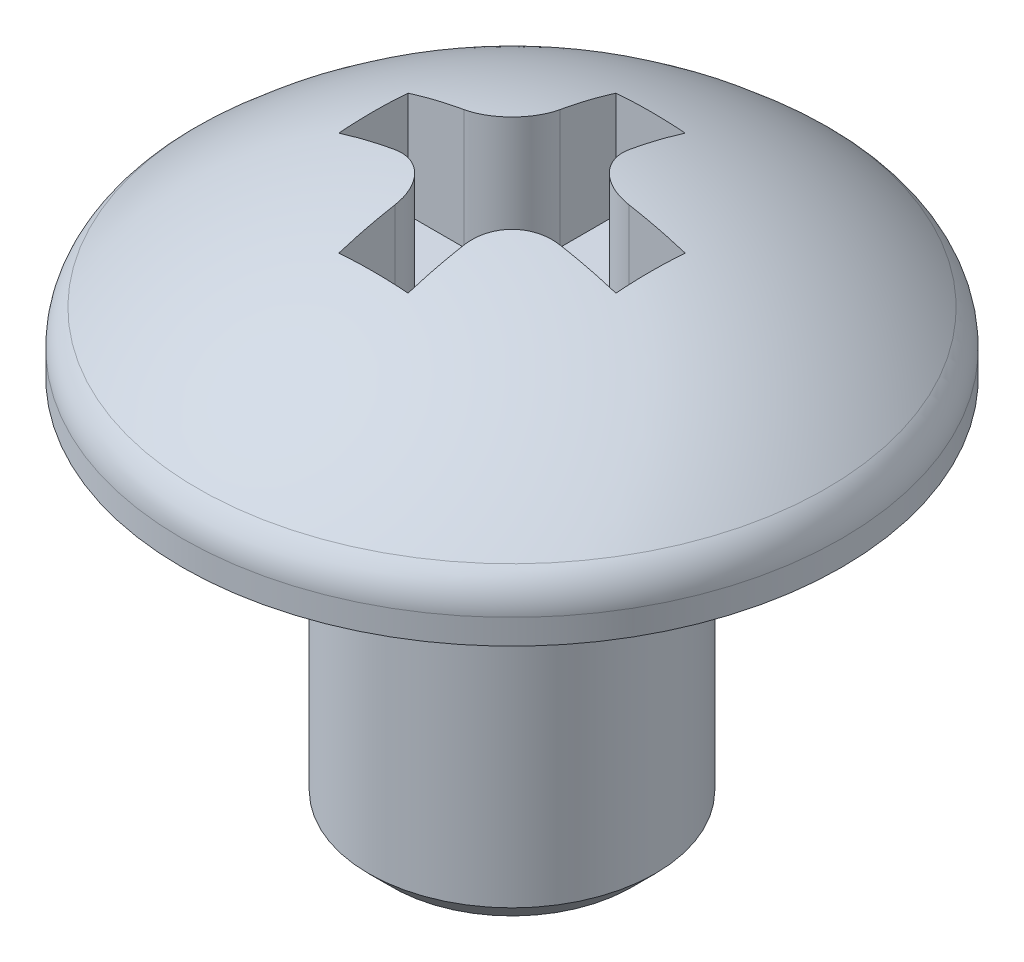
ISO-10303-21;
HEADER;
FILE_DESCRIPTION(('STEP AP214'),'2;1');
FILE_NAME('part.step','',(''),(''),'','','');
FILE_SCHEMA(('AUTOMOTIVE_DESIGN { 1 0 10303 214 1 1 1 1 }'));
ENDSEC;
DATA;
#1=APPLICATION_CONTEXT('core data for automotive mechanical design processes');
#2=APPLICATION_PROTOCOL_DEFINITION('international standard','automotive_design',2000,#1);
#3=PRODUCT_CONTEXT('',#1,'mechanical');
#4=PRODUCT('Part','Part','',(#3));
#5=PRODUCT_RELATED_PRODUCT_CATEGORY('part','',(#4));
#6=PRODUCT_DEFINITION_FORMATION('','',#4);
#7=PRODUCT_DEFINITION_CONTEXT('part definition',#1,'design');
#8=PRODUCT_DEFINITION('design','',#6,#7);
#9=PRODUCT_DEFINITION_SHAPE('','',#8);
#10=(LENGTH_UNIT() NAMED_UNIT(*) SI_UNIT(.MILLI.,.METRE.));
#11=(NAMED_UNIT(*) PLANE_ANGLE_UNIT() SI_UNIT($,.RADIAN.));
#12=(NAMED_UNIT(*) SI_UNIT($,.STERADIAN.) SOLID_ANGLE_UNIT());
#13=UNCERTAINTY_MEASURE_WITH_UNIT(LENGTH_MEASURE(1.E-05),#10,'distance_accuracy_value','');
#14=(GEOMETRIC_REPRESENTATION_CONTEXT(3) GLOBAL_UNCERTAINTY_ASSIGNED_CONTEXT((#13)) GLOBAL_UNIT_ASSIGNED_CONTEXT((#10,
#11,#12)) REPRESENTATION_CONTEXT('',''));
#15=CARTESIAN_POINT('',(0.,0.,0.));
#16=DIRECTION('',(0.,0.,1.));
#17=DIRECTION('',(1.,0.,0.));
#18=AXIS2_PLACEMENT_3D('',#15,#16,#17);
#19=CARTESIAN_POINT('',(0.,-4.,0.));
#20=DIRECTION('',(0.,-1.,0.));
#21=DIRECTION('',(0.,0.,-1.));
#22=AXIS2_PLACEMENT_3D('',#19,#20,#21);
#23=PLANE('',#22);
#24=CARTESIAN_POINT('',(0.,-4.,0.));
#25=DIRECTION('',(0.,-1.,0.));
#26=DIRECTION('',(0.,0.,-1.));
#27=AXIS2_PLACEMENT_3D('',#24,#25,#26);
#28=CIRCLE('',#27,1.25);
#29=CARTESIAN_POINT('',(0.,-4.,-1.25));
#30=VERTEX_POINT('',#29);
#31=EDGE_CURVE('E290',#30,#30,#28,.T.);
#32=ORIENTED_EDGE('',*,*,#31,.T.);
#33=EDGE_LOOP('',(#32));
#34=FACE_BOUND('',#33,.T.);
#35=ADVANCED_FACE('F39',(#34),#23,.T.);
#36=CARTESIAN_POINT('',(0.,-2.98881578947368,0.));
#37=DIRECTION('',(0.,-1.,0.));
#38=DIRECTION('',(0.,0.,-1.));
#39=AXIS2_PLACEMENT_3D('',#36,#37,#38);
#40=CYLINDRICAL_SURFACE('',#39,1.5);
#41=CARTESIAN_POINT('',(0.,-3.75,0.));
#42=DIRECTION('',(0.,-1.,0.));
#43=DIRECTION('',(0.,0.,-1.));
#44=AXIS2_PLACEMENT_3D('',#41,#42,#43);
#45=CIRCLE('',#44,1.5);
#46=CARTESIAN_POINT('',(0.,-3.75,-1.5));
#47=VERTEX_POINT('',#46);
#48=EDGE_CURVE('E294',#47,#47,#45,.F.);
#49=ORIENTED_EDGE('',*,*,#48,.T.);
#50=EDGE_LOOP('',(#49));
#51=FACE_BOUND('',#50,.T.);
#52=CARTESIAN_POINT('',(0.,0.,0.));
#53=DIRECTION('',(0.,-1.,0.));
#54=DIRECTION('',(0.,0.,-1.));
#55=AXIS2_PLACEMENT_3D('',#52,#53,#54);
#56=CIRCLE('',#55,1.5);
#57=CARTESIAN_POINT('',(0.,0.,-1.5));
#58=VERTEX_POINT('',#57);
#59=EDGE_CURVE('E248',#58,#58,#56,.T.);
#60=ORIENTED_EDGE('',*,*,#59,.T.);
#61=EDGE_LOOP('',(#60));
#62=FACE_BOUND('',#61,.T.);
#63=ADVANCED_FACE('F369',(#51,#62),#40,.T.);
#64=CARTESIAN_POINT('',(1.5,0.,0.));
#65=DIRECTION('',(0.,-1.,0.));
#66=DIRECTION('',(0.,0.,-1.));
#67=AXIS2_PLACEMENT_3D('',#64,#65,#66);
#68=PLANE('',#67);
#69=CARTESIAN_POINT('',(0.,0.,0.));
#70=DIRECTION('',(0.,-1.,0.));
#71=DIRECTION('',(0.,0.,-1.));
#72=AXIS2_PLACEMENT_3D('',#69,#70,#71);
#73=CIRCLE('',#72,3.45);
#74=CARTESIAN_POINT('',(0.,0.,-3.45));
#75=VERTEX_POINT('',#74);
#76=EDGE_CURVE('E222',#75,#75,#73,.T.);
#77=ORIENTED_EDGE('',*,*,#76,.T.);
#78=EDGE_LOOP('',(#77));
#79=FACE_BOUND('',#78,.T.);
#80=ORIENTED_EDGE('',*,*,#59,.F.);
#81=EDGE_LOOP('',(#80));
#82=FACE_BOUND('',#81,.T.);
#83=ADVANCED_FACE('F375',(#79,#82),#68,.T.);
#84=CARTESIAN_POINT('',(0.,-2.98881578947368,0.));
#85=DIRECTION('',(0.,-1.,0.));
#86=DIRECTION('',(0.,0.,-1.));
#87=AXIS2_PLACEMENT_3D('',#84,#85,#86);
#88=CYLINDRICAL_SURFACE('',#87,3.45);
#89=CARTESIAN_POINT('',(0.,0.260677099260421,0.));
#90=DIRECTION('',(0.,-1.,0.));
#91=DIRECTION('',(0.,0.,-1.));
#92=AXIS2_PLACEMENT_3D('',#89,#90,#91);
#93=CIRCLE('',#92,3.45);
#94=CARTESIAN_POINT('',(0.,0.260677099260421,-3.45));
#95=VERTEX_POINT('',#94);
#96=EDGE_CURVE('E298',#95,#95,#93,.T.);
#97=ORIENTED_EDGE('',*,*,#96,.T.);
#98=EDGE_LOOP('',(#97));
#99=FACE_BOUND('',#98,.T.);
#100=ORIENTED_EDGE('',*,*,#76,.F.);
#101=EDGE_LOOP('',(#100));
#102=FACE_BOUND('',#101,.T.);
#103=ADVANCED_FACE('F330',(#99,#102),#88,.T.);
#104=CARTESIAN_POINT('',(0.,-2.98881578947368,0.));
#105=DIRECTION('',(0.,-1.,0.));
#106=DIRECTION('',(1.,0.,0.));
#107=AXIS2_PLACEMENT_3D('',#104,#105,#106);
#108=SPHERICAL_SURFACE('',#107,4.88881578947368);
#109=CARTESIAN_POINT('',(0.,0.630878657563212,0.));
#110=DIRECTION('',(0.,-1.,0.));
#111=DIRECTION('',(0.,0.,-1.));
#112=AXIS2_PLACEMENT_3D('',#109,#110,#111);
#113=CIRCLE('',#112,3.28608154699445);
#114=CARTESIAN_POINT('',(0.,0.630878657563212,-3.28608154699445));
#115=VERTEX_POINT('',#114);
#116=EDGE_CURVE('E302',#115,#115,#113,.F.);
#117=ORIENTED_EDGE('',*,*,#116,.T.);
#118=EDGE_LOOP('',(#117));
#119=FACE_BOUND('',#118,.T.);
#120=CARTESIAN_POINT('',(0.3625,-2.98881578947368,0.));
#121=DIRECTION('',(1.,0.,0.));
#122=DIRECTION('',(0.,1.,0.));
#123=AXIS2_PLACEMENT_3D('',#120,#121,#122);
#124=CIRCLE('',#123,4.87535778927118);
#125=CARTESIAN_POINT('',(0.3625,1.80964305930341,-0.8625));
#126=VERTEX_POINT('',#125);
#127=CARTESIAN_POINT('',(0.3625,1.66592518864821,-1.45));
#128=VERTEX_POINT('',#127);
#129=EDGE_CURVE('E261',#126,#128,#124,.F.);
#130=ORIENTED_EDGE('',*,*,#129,.F.);
#131=CARTESIAN_POINT('',(0.3625,1.80964305930341,-0.8625));
#132=CARTESIAN_POINT('',(0.362474984330212,1.81458901663672,-0.835008086916657));
#133=CARTESIAN_POINT('',(0.364766478646116,1.81912532452881,-0.807436934429498));
#134=CARTESIAN_POINT('',(0.373881738456344,1.82726466074009,-0.752911435473409));
#135=CARTESIAN_POINT('',(0.380705875103945,1.83086761259828,-0.725957139702487));
#136=CARTESIAN_POINT('',(0.398796117521395,1.83702897643715,-0.673414970369721));
#137=CARTESIAN_POINT('',(0.410067361638038,1.83958617312967,-0.647828716463168));
#138=CARTESIAN_POINT('',(0.436755181423926,1.84356882213686,-0.598836301672854));
#139=CARTESIAN_POINT('',(0.452169647059879,1.84499484906983,-0.575429039233045));
#140=CARTESIAN_POINT('',(0.486426910043481,1.84665650158124,-0.531857569207788));
#141=CARTESIAN_POINT('',(0.505208402721074,1.84691153743254,-0.511645885216154));
#142=CARTESIAN_POINT('',(0.545828879305455,1.84627593668335,-0.474588756392626));
#143=CARTESIAN_POINT('',(0.56766815873061,1.84538518928096,-0.457743637303228));
#144=CARTESIAN_POINT('',(0.613578932407292,1.84249787953292,-0.428010978253064));
#145=CARTESIAN_POINT('',(0.637631662610505,1.84051000721163,-0.4150935594696));
#146=CARTESIAN_POINT('',(0.687425484927454,1.83549479708483,-0.393366362379773));
#147=CARTESIAN_POINT('',(0.713166385454016,1.83246757706831,-0.384556118875051));
#148=CARTESIAN_POINT('',(0.75956584161618,1.82627155430307,-0.372766580123835));
#149=CARTESIAN_POINT('',(0.780033517017297,1.82329502990789,-0.36891272295313));
#150=CARTESIAN_POINT('',(0.82118010684044,1.8168360204088,-0.363778388588093));
#151=CARTESIAN_POINT('',(0.841858674272663,1.81335427075325,-0.362494210267858));
#152=CARTESIAN_POINT('',(0.8625,1.80964305930341,-0.3625));
#153=B_SPLINE_CURVE_WITH_KNOTS('',3,(#131,#132,#133,#134,#135,#136,#137,#138,#139,#140,#141,
#142,#143,#144,#145,#146,#147,#148,#149,#150,#151,#152),.UNSPECIFIED.,.F.,.F.,(4,2,2,2,2,2,2,2,
2,2,4),(0.,0.0837112436698744,0.167429342840594,0.251244457505583,0.33501696795728,
0.417395734981541,0.49978246896561,0.581525815714419,0.663259901569092,0.726217835980782,
0.789085026194298),.UNSPECIFIED.);
#154=CARTESIAN_POINT('',(0.8625,1.80964305930341,-0.3625));
#155=VERTEX_POINT('',#154);
#156=EDGE_CURVE('E345',#126,#155,#153,.T.);
#157=ORIENTED_EDGE('',*,*,#156,.T.);
#158=CARTESIAN_POINT('',(0.,-2.98881578947368,-0.3625));
#159=DIRECTION('',(0.,0.,-1.));
#160=DIRECTION('',(-1.,0.,0.));
#161=AXIS2_PLACEMENT_3D('',#158,#159,#160);
#162=CIRCLE('',#161,4.87535778927118);
#163=CARTESIAN_POINT('',(1.45,1.66592518864821,-0.3625));
#164=VERTEX_POINT('',#163);
#165=EDGE_CURVE('E257',#164,#155,#162,.F.);
#166=ORIENTED_EDGE('',*,*,#165,.F.);
#167=CARTESIAN_POINT('',(1.45,-2.98881578947368,0.));
#168=DIRECTION('',(1.,0.,0.));
#169=DIRECTION('',(0.,1.,0.));
#170=AXIS2_PLACEMENT_3D('',#167,#168,#169);
#171=CIRCLE('',#170,4.66883495354111);
#172=CARTESIAN_POINT('',(1.45,1.66592518864821,0.3625));
#173=VERTEX_POINT('',#172);
#174=EDGE_CURVE('E254',#173,#164,#171,.F.);
#175=ORIENTED_EDGE('',*,*,#174,.F.);
#176=CARTESIAN_POINT('',(0.,-2.98881578947368,0.3625));
#177=DIRECTION('',(0.,0.,1.));
#178=DIRECTION('',(1.,0.,0.));
#179=AXIS2_PLACEMENT_3D('',#176,#177,#178);
#180=CIRCLE('',#179,4.87535778927118);
#181=CARTESIAN_POINT('',(0.8625,1.80964305930341,0.3625));
#182=VERTEX_POINT('',#181);
#183=EDGE_CURVE('E172',#182,#173,#180,.F.);
#184=ORIENTED_EDGE('',*,*,#183,.F.);
#185=CARTESIAN_POINT('',(0.8625,1.80964305930341,0.3625));
#186=CARTESIAN_POINT('',(0.835008086916657,1.81458901663672,0.362474984330212));
#187=CARTESIAN_POINT('',(0.807436934429499,1.81912532452881,0.364766478646116));
#188=CARTESIAN_POINT('',(0.752911435473409,1.82726466074009,0.373881738456344));
#189=CARTESIAN_POINT('',(0.725957139702487,1.83086761259828,0.380705875103945));
#190=CARTESIAN_POINT('',(0.673414970369721,1.83702897643715,0.398796117521395));
#191=CARTESIAN_POINT('',(0.647828716463168,1.83958617312967,0.410067361638038));
#192=CARTESIAN_POINT('',(0.598836301672854,1.84356882213686,0.436755181423926));
#193=CARTESIAN_POINT('',(0.575429039233045,1.84499484906983,0.452169647059879));
#194=CARTESIAN_POINT('',(0.531857569207788,1.84665650158124,0.486426910043481));
#195=CARTESIAN_POINT('',(0.511645885216154,1.84691153743254,0.505208402721074));
#196=CARTESIAN_POINT('',(0.474588756392626,1.84627593668335,0.545828879305455));
#197=CARTESIAN_POINT('',(0.457743637303228,1.84538518928096,0.56766815873061));
#198=CARTESIAN_POINT('',(0.428010978253065,1.84249787953292,0.613578932407291));
#199=CARTESIAN_POINT('',(0.4150935594696,1.84051000721163,0.637631662610505));
#200=CARTESIAN_POINT('',(0.393366362379773,1.83549479708483,0.687425484927453));
#201=CARTESIAN_POINT('',(0.384556118875052,1.83246757706831,0.713166385454016));
#202=CARTESIAN_POINT('',(0.372766580123835,1.82627155430307,0.75956584161618));
#203=CARTESIAN_POINT('',(0.36891272295313,1.82329502990789,0.780033517017297));
#204=CARTESIAN_POINT('',(0.363778388588093,1.8168360204088,0.82118010684044));
#205=CARTESIAN_POINT('',(0.362494210267859,1.81335427075325,0.841858674272663));
#206=CARTESIAN_POINT('',(0.3625,1.80964305930341,0.8625));
#207=B_SPLINE_CURVE_WITH_KNOTS('',3,(#185,#186,#187,#188,#189,#190,#191,#192,#193,#194,#195,
#196,#197,#198,#199,#200,#201,#202,#203,#204,#205,#206),.UNSPECIFIED.,.F.,.F.,(4,2,2,2,2,2,2,2,
2,2,4),(0.,0.0837112436698745,0.167429342840595,0.251244457505583,0.33501696795728,
0.417395734981541,0.499782468965611,0.581525815714419,0.663259901569092,0.726217835980782,
0.789085026194298),.UNSPECIFIED.);
#208=CARTESIAN_POINT('',(0.3625,1.80964305930341,0.8625));
#209=VERTEX_POINT('',#208);
#210=EDGE_CURVE('E338',#182,#209,#207,.T.);
#211=ORIENTED_EDGE('',*,*,#210,.T.);
#212=CARTESIAN_POINT('',(0.3625,-2.98881578947368,0.));
#213=DIRECTION('',(1.,0.,0.));
#214=DIRECTION('',(0.,1.,0.));
#215=AXIS2_PLACEMENT_3D('',#212,#213,#214);
#216=CIRCLE('',#215,4.87535778927118);
#217=CARTESIAN_POINT('',(0.3625,1.66592518864821,1.45));
#218=VERTEX_POINT('',#217);
#219=EDGE_CURVE('E286',#218,#209,#216,.F.);
#220=ORIENTED_EDGE('',*,*,#219,.F.);
#221=CARTESIAN_POINT('',(0.,-2.98881578947368,1.45));
#222=DIRECTION('',(0.,0.,1.));
#223=DIRECTION('',(1.,0.,0.));
#224=AXIS2_PLACEMENT_3D('',#221,#222,#223);
#225=CIRCLE('',#224,4.66883495354111);
#226=CARTESIAN_POINT('',(-0.3625,1.66592518864821,1.45));
#227=VERTEX_POINT('',#226);
#228=EDGE_CURVE('E283',#227,#218,#225,.F.);
#229=ORIENTED_EDGE('',*,*,#228,.F.);
#230=CARTESIAN_POINT('',(-0.3625,-2.98881578947368,0.));
#231=DIRECTION('',(-1.,0.,0.));
#232=DIRECTION('',(0.,0.,1.));
#233=AXIS2_PLACEMENT_3D('',#230,#231,#232);
#234=CIRCLE('',#233,4.87535778927118);
#235=CARTESIAN_POINT('',(-0.3625,1.80964305930341,0.8625));
#236=VERTEX_POINT('',#235);
#237=EDGE_CURVE('E280',#236,#227,#234,.F.);
#238=ORIENTED_EDGE('',*,*,#237,.F.);
#239=CARTESIAN_POINT('',(-0.3625,1.80964305930341,0.8625));
#240=CARTESIAN_POINT('',(-0.362474984330211,1.81458901663672,0.835008086916657));
#241=CARTESIAN_POINT('',(-0.364766478646116,1.81912532452881,0.807436934429499));
#242=CARTESIAN_POINT('',(-0.373881738456344,1.82726466074009,0.752911435473409));
#243=CARTESIAN_POINT('',(-0.380705875103944,1.83086761259828,0.725957139702487));
#244=CARTESIAN_POINT('',(-0.398796117521395,1.83702897643715,0.673414970369721));
#245=CARTESIAN_POINT('',(-0.410067361638038,1.83958617312967,0.647828716463168));
#246=CARTESIAN_POINT('',(-0.436755181423926,1.84356882213686,0.598836301672854));
#247=CARTESIAN_POINT('',(-0.452169647059879,1.84499484906983,0.575429039233045));
#248=CARTESIAN_POINT('',(-0.486426910043481,1.84665650158124,0.531857569207788));
#249=CARTESIAN_POINT('',(-0.505208402721074,1.84691153743254,0.511645885216154));
#250=CARTESIAN_POINT('',(-0.545828879305455,1.84627593668335,0.474588756392626));
#251=CARTESIAN_POINT('',(-0.56766815873061,1.84538518928096,0.457743637303228));
#252=CARTESIAN_POINT('',(-0.613578932407291,1.84249787953292,0.428010978253064));
#253=CARTESIAN_POINT('',(-0.637631662610505,1.84051000721163,0.4150935594696));
#254=CARTESIAN_POINT('',(-0.687425484927453,1.83549479708483,0.393366362379773));
#255=CARTESIAN_POINT('',(-0.713166385454016,1.83246757706831,0.384556118875051));
#256=CARTESIAN_POINT('',(-0.75956584161618,1.82627155430307,0.372766580123835));
#257=CARTESIAN_POINT('',(-0.780033517017297,1.82329502990789,0.36891272295313));
#258=CARTESIAN_POINT('',(-0.82118010684044,1.8168360204088,0.363778388588093));
#259=CARTESIAN_POINT('',(-0.841858674272663,1.81335427075325,0.362494210267858));
#260=CARTESIAN_POINT('',(-0.8625,1.80964305930341,0.3625));
#261=B_SPLINE_CURVE_WITH_KNOTS('',3,(#239,#240,#241,#242,#243,#244,#245,#246,#247,#248,#249,
#250,#251,#252,#253,#254,#255,#256,#257,#258,#259,#260),.UNSPECIFIED.,.F.,.F.,(4,2,2,2,2,2,2,2,
2,2,4),(0.,0.0837112436698745,0.167429342840595,0.251244457505583,0.33501696795728,
0.417395734981541,0.499782468965611,0.581525815714419,0.663259901569092,0.726217835980782,
0.789085026194298),.UNSPECIFIED.);
#262=CARTESIAN_POINT('',(-0.8625,1.80964305930341,0.3625));
#263=VERTEX_POINT('',#262);
#264=EDGE_CURVE('E318',#236,#263,#261,.T.);
#265=ORIENTED_EDGE('',*,*,#264,.T.);
#266=CARTESIAN_POINT('',(0.,-2.98881578947368,0.3625));
#267=DIRECTION('',(0.,0.,1.));
#268=DIRECTION('',(1.,0.,0.));
#269=AXIS2_PLACEMENT_3D('',#266,#267,#268);
#270=CIRCLE('',#269,4.87535778927118);
#271=CARTESIAN_POINT('',(-1.45,1.66592518864821,0.3625));
#272=VERTEX_POINT('',#271);
#273=EDGE_CURVE('E276',#272,#263,#270,.F.);
#274=ORIENTED_EDGE('',*,*,#273,.F.);
#275=CARTESIAN_POINT('',(-1.45,-2.98881578947368,0.));
#276=DIRECTION('',(-1.,0.,0.));
#277=DIRECTION('',(0.,-1.,0.));
#278=AXIS2_PLACEMENT_3D('',#275,#276,#277);
#279=CIRCLE('',#278,4.66883495354111);
#280=CARTESIAN_POINT('',(-1.45,1.66592518864821,-0.3625));
#281=VERTEX_POINT('',#280);
#282=EDGE_CURVE('E273',#281,#272,#279,.F.);
#283=ORIENTED_EDGE('',*,*,#282,.F.);
#284=CARTESIAN_POINT('',(0.,-2.98881578947368,-0.3625));
#285=DIRECTION('',(0.,0.,-1.));
#286=DIRECTION('',(-1.,0.,0.));
#287=AXIS2_PLACEMENT_3D('',#284,#285,#286);
#288=CIRCLE('',#287,4.87535778927118);
#289=CARTESIAN_POINT('',(-0.8625,1.80964305930341,-0.3625));
#290=VERTEX_POINT('',#289);
#291=EDGE_CURVE('E270',#290,#281,#288,.F.);
#292=ORIENTED_EDGE('',*,*,#291,.F.);
#293=CARTESIAN_POINT('',(-0.8625,1.80964305930341,-0.3625));
#294=CARTESIAN_POINT('',(-0.835008086916657,1.81458901663672,-0.362474984330211));
#295=CARTESIAN_POINT('',(-0.807436934429498,1.81912532452881,-0.364766478646116));
#296=CARTESIAN_POINT('',(-0.752911435473409,1.82726466074009,-0.373881738456344));
#297=CARTESIAN_POINT('',(-0.725957139702487,1.83086761259828,-0.380705875103944));
#298=CARTESIAN_POINT('',(-0.673414970369721,1.83702897643715,-0.398796117521395));
#299=CARTESIAN_POINT('',(-0.647828716463168,1.83958617312967,-0.410067361638038));
#300=CARTESIAN_POINT('',(-0.598836301672854,1.84356882213686,-0.436755181423926));
#301=CARTESIAN_POINT('',(-0.575429039233045,1.84499484906983,-0.452169647059879));
#302=CARTESIAN_POINT('',(-0.531857569207788,1.84665650158124,-0.486426910043481));
#303=CARTESIAN_POINT('',(-0.511645885216154,1.84691153743254,-0.505208402721074));
#304=CARTESIAN_POINT('',(-0.474588756392626,1.84627593668335,-0.545828879305455));
#305=CARTESIAN_POINT('',(-0.457743637303228,1.84538518928096,-0.567668158730609));
#306=CARTESIAN_POINT('',(-0.428010978253064,1.84249787953292,-0.613578932407291));
#307=CARTESIAN_POINT('',(-0.4150935594696,1.84051000721163,-0.637631662610504));
#308=CARTESIAN_POINT('',(-0.393366362379773,1.83549479708483,-0.687425484927453));
#309=CARTESIAN_POINT('',(-0.384556118875052,1.83246757706831,-0.713166385454016));
#310=CARTESIAN_POINT('',(-0.372766580123835,1.82627155430307,-0.75956584161618));
#311=CARTESIAN_POINT('',(-0.36891272295313,1.82329502990789,-0.780033517017297));
#312=CARTESIAN_POINT('',(-0.363778388588093,1.8168360204088,-0.82118010684044));
#313=CARTESIAN_POINT('',(-0.362494210267858,1.81335427075325,-0.841858674272663));
#314=CARTESIAN_POINT('',(-0.3625,1.80964305930341,-0.8625));
#315=B_SPLINE_CURVE_WITH_KNOTS('',3,(#293,#294,#295,#296,#297,#298,#299,#300,#301,#302,#303,
#304,#305,#306,#307,#308,#309,#310,#311,#312,#313,#314),.UNSPECIFIED.,.F.,.F.,(4,2,2,2,2,2,2,2,
2,2,4),(0.,0.0837112436698745,0.167429342840595,0.251244457505583,0.33501696795728,
0.417395734981541,0.499782468965611,0.581525815714419,0.663259901569092,0.726217835980782,
0.789085026194298),.UNSPECIFIED.);
#316=CARTESIAN_POINT('',(-0.3625,1.80964305930341,-0.8625));
#317=VERTEX_POINT('',#316);
#318=EDGE_CURVE('E310',#290,#317,#315,.T.);
#319=ORIENTED_EDGE('',*,*,#318,.T.);
#320=CARTESIAN_POINT('',(-0.3625,-2.98881578947368,0.));
#321=DIRECTION('',(-1.,0.,0.));
#322=DIRECTION('',(0.,0.,1.));
#323=AXIS2_PLACEMENT_3D('',#320,#321,#322);
#324=CIRCLE('',#323,4.87535778927118);
#325=CARTESIAN_POINT('',(-0.3625,1.66592518864821,-1.45));
#326=VERTEX_POINT('',#325);
#327=EDGE_CURVE('E267',#326,#317,#324,.F.);
#328=ORIENTED_EDGE('',*,*,#327,.F.);
#329=CARTESIAN_POINT('',(0.,-2.98881578947368,-1.45));
#330=DIRECTION('',(0.,0.,-1.));
#331=DIRECTION('',(-1.,0.,0.));
#332=AXIS2_PLACEMENT_3D('',#329,#330,#331);
#333=CIRCLE('',#332,4.66883495354111);
#334=EDGE_CURVE('E264',#128,#326,#333,.F.);
#335=ORIENTED_EDGE('',*,*,#334,.F.);
#336=EDGE_LOOP('',(#130,#157,#166,#175,#184,#211,#220,#229,#238,#265,#274,#283,#292,#319,#328,#335));
#337=FACE_BOUND('',#336,.T.);
#338=ADVANCED_FACE('F324',(#119,#337),#108,.T.);
#339=CARTESIAN_POINT('',(0.3625,0.56,0.3625));
#340=DIRECTION('',(1.,0.,0.));
#341=DIRECTION('',(0.,1.,0.));
#342=AXIS2_PLACEMENT_3D('',#339,#340,#341);
#343=PLANE('',#342);
#344=ORIENTED_EDGE('',*,*,#219,.T.);
#345=DIRECTION('',(0.,1.,0.));
#346=VECTOR('',#345,1.);
#347=CARTESIAN_POINT('',(0.3625,0.56,0.8625));
#348=LINE('',#347,#346);
#349=CARTESIAN_POINT('',(0.3625,0.56,0.8625));
#350=VERTEX_POINT('',#349);
#351=EDGE_CURVE('E615',#209,#350,#348,.F.);
#352=ORIENTED_EDGE('',*,*,#351,.T.);
#353=DIRECTION('',(0.,0.,-1.));
#354=VECTOR('',#353,1.);
#355=CARTESIAN_POINT('',(0.3625,0.56,0.3625));
#356=LINE('',#355,#354);
#357=CARTESIAN_POINT('',(0.3625,0.56,1.45));
#358=VERTEX_POINT('',#357);
#359=EDGE_CURVE('E166',#358,#350,#356,.T.);
#360=ORIENTED_EDGE('',*,*,#359,.F.);
#361=DIRECTION('',(0.,1.,0.));
#362=VECTOR('',#361,1.);
#363=CARTESIAN_POINT('',(0.3625,0.56,1.45));
#364=LINE('',#363,#362);
#365=EDGE_CURVE('E218',#358,#218,#364,.T.);
#366=ORIENTED_EDGE('',*,*,#365,.T.);
#367=EDGE_LOOP('',(#344,#352,#360,#366));
#368=FACE_BOUND('',#367,.T.);
#369=ADVANCED_FACE('F329',(#368),#343,.F.);
#370=CARTESIAN_POINT('',(0.3625,0.56,1.45));
#371=DIRECTION('',(0.,0.,1.));
#372=DIRECTION('',(1.,0.,0.));
#373=AXIS2_PLACEMENT_3D('',#370,#371,#372);
#374=PLANE('',#373);
#375=ORIENTED_EDGE('',*,*,#228,.T.);
#376=ORIENTED_EDGE('',*,*,#365,.F.);
#377=DIRECTION('',(1.,0.,0.));
#378=VECTOR('',#377,1.);
#379=CARTESIAN_POINT('',(0.3625,0.56,1.45));
#380=LINE('',#379,#378);
#381=CARTESIAN_POINT('',(-0.3625,0.56,1.45));
#382=VERTEX_POINT('',#381);
#383=EDGE_CURVE('E177',#382,#358,#380,.T.);
#384=ORIENTED_EDGE('',*,*,#383,.F.);
#385=DIRECTION('',(0.,1.,0.));
#386=VECTOR('',#385,1.);
#387=CARTESIAN_POINT('',(-0.3625,0.56,1.45));
#388=LINE('',#387,#386);
#389=EDGE_CURVE('E223',#382,#227,#388,.T.);
#390=ORIENTED_EDGE('',*,*,#389,.T.);
#391=EDGE_LOOP('',(#375,#376,#384,#390));
#392=FACE_BOUND('',#391,.T.);
#393=ADVANCED_FACE('F416',(#392),#374,.F.);
#394=CARTESIAN_POINT('',(-0.3625,0.56,1.45));
#395=DIRECTION('',(-1.,0.,0.));
#396=DIRECTION('',(0.,0.,1.));
#397=AXIS2_PLACEMENT_3D('',#394,#395,#396);
#398=PLANE('',#397);
#399=DIRECTION('',(0.,0.,1.));
#400=VECTOR('',#399,1.);
#401=CARTESIAN_POINT('',(-0.3625,0.56,1.45));
#402=LINE('',#401,#400);
#403=CARTESIAN_POINT('',(-0.3625,0.56,0.8625));
#404=VERTEX_POINT('',#403);
#405=EDGE_CURVE('E212',#404,#382,#402,.T.);
#406=ORIENTED_EDGE('',*,*,#405,.F.);
#407=DIRECTION('',(0.,1.,0.));
#408=VECTOR('',#407,1.);
#409=CARTESIAN_POINT('',(-0.3625,0.56,0.8625));
#410=LINE('',#409,#408);
#411=EDGE_CURVE('E620',#404,#236,#410,.T.);
#412=ORIENTED_EDGE('',*,*,#411,.T.);
#413=ORIENTED_EDGE('',*,*,#237,.T.);
#414=ORIENTED_EDGE('',*,*,#389,.F.);
#415=EDGE_LOOP('',(#406,#412,#413,#414));
#416=FACE_BOUND('',#415,.T.);
#417=ADVANCED_FACE('F422',(#416),#398,.F.);
#418=CARTESIAN_POINT('',(-0.3625,0.56,0.3625));
#419=DIRECTION('',(0.,0.,1.));
#420=DIRECTION('',(1.,0.,0.));
#421=AXIS2_PLACEMENT_3D('',#418,#419,#420);
#422=PLANE('',#421);
#423=ORIENTED_EDGE('',*,*,#273,.T.);
#424=DIRECTION('',(0.,1.,0.));
#425=VECTOR('',#424,1.);
#426=CARTESIAN_POINT('',(-0.8625,0.56,0.3625));
#427=LINE('',#426,#425);
#428=CARTESIAN_POINT('',(-0.8625,0.56,0.3625));
#429=VERTEX_POINT('',#428);
#430=EDGE_CURVE('E624',#263,#429,#427,.F.);
#431=ORIENTED_EDGE('',*,*,#430,.T.);
#432=DIRECTION('',(1.,0.,0.));
#433=VECTOR('',#432,1.);
#434=CARTESIAN_POINT('',(-0.3625,0.56,0.3625));
#435=LINE('',#434,#433);
#436=CARTESIAN_POINT('',(-1.45,0.56,0.3625));
#437=VERTEX_POINT('',#436);
#438=EDGE_CURVE('E208',#437,#429,#435,.T.);
#439=ORIENTED_EDGE('',*,*,#438,.F.);
#440=DIRECTION('',(0.,1.,0.));
#441=VECTOR('',#440,1.);
#442=CARTESIAN_POINT('',(-1.45,0.56,0.3625));
#443=LINE('',#442,#441);
#444=EDGE_CURVE('E227',#437,#272,#443,.T.);
#445=ORIENTED_EDGE('',*,*,#444,.T.);
#446=EDGE_LOOP('',(#423,#431,#439,#445));
#447=FACE_BOUND('',#446,.T.);
#448=ADVANCED_FACE('F429',(#447),#422,.F.);
#449=CARTESIAN_POINT('',(-1.45,0.56,0.3625));
#450=DIRECTION('',(-1.,0.,0.));
#451=DIRECTION('',(0.,-1.,0.));
#452=AXIS2_PLACEMENT_3D('',#449,#450,#451);
#453=PLANE('',#452);
#454=ORIENTED_EDGE('',*,*,#282,.T.);
#455=ORIENTED_EDGE('',*,*,#444,.F.);
#456=DIRECTION('',(0.,0.,1.));
#457=VECTOR('',#456,1.);
#458=CARTESIAN_POINT('',(-1.45,0.56,0.3625));
#459=LINE('',#458,#457);
#460=CARTESIAN_POINT('',(-1.45,0.56,-0.3625));
#461=VERTEX_POINT('',#460);
#462=EDGE_CURVE('E204',#461,#437,#459,.T.);
#463=ORIENTED_EDGE('',*,*,#462,.F.);
#464=DIRECTION('',(0.,1.,0.));
#465=VECTOR('',#464,1.);
#466=CARTESIAN_POINT('',(-1.45,0.56,-0.3625));
#467=LINE('',#466,#465);
#468=EDGE_CURVE('E231',#461,#281,#467,.T.);
#469=ORIENTED_EDGE('',*,*,#468,.T.);
#470=EDGE_LOOP('',(#454,#455,#463,#469));
#471=FACE_BOUND('',#470,.T.);
#472=ADVANCED_FACE('F436',(#471),#453,.F.);
#473=CARTESIAN_POINT('',(-1.45,0.56,-0.3625));
#474=DIRECTION('',(0.,0.,-1.));
#475=DIRECTION('',(-1.,0.,0.));
#476=AXIS2_PLACEMENT_3D('',#473,#474,#475);
#477=PLANE('',#476);
#478=DIRECTION('',(-1.,0.,0.));
#479=VECTOR('',#478,1.);
#480=CARTESIAN_POINT('',(-1.45,0.56,-0.3625));
#481=LINE('',#480,#479);
#482=CARTESIAN_POINT('',(-0.8625,0.56,-0.3625));
#483=VERTEX_POINT('',#482);
#484=EDGE_CURVE('E201',#483,#461,#481,.T.);
#485=ORIENTED_EDGE('',*,*,#484,.F.);
#486=DIRECTION('',(0.,1.,0.));
#487=VECTOR('',#486,1.);
#488=CARTESIAN_POINT('',(-0.8625,0.56,-0.3625));
#489=LINE('',#488,#487);
#490=EDGE_CURVE('E627',#483,#290,#489,.T.);
#491=ORIENTED_EDGE('',*,*,#490,.T.);
#492=ORIENTED_EDGE('',*,*,#291,.T.);
#493=ORIENTED_EDGE('',*,*,#468,.F.);
#494=EDGE_LOOP('',(#485,#491,#492,#493));
#495=FACE_BOUND('',#494,.T.);
#496=ADVANCED_FACE('F443',(#495),#477,.F.);
#497=CARTESIAN_POINT('',(-0.3625,0.56,-0.3625));
#498=DIRECTION('',(-1.,0.,0.));
#499=DIRECTION('',(0.,0.,1.));
#500=AXIS2_PLACEMENT_3D('',#497,#498,#499);
#501=PLANE('',#500);
#502=ORIENTED_EDGE('',*,*,#327,.T.);
#503=DIRECTION('',(0.,1.,0.));
#504=VECTOR('',#503,1.);
#505=CARTESIAN_POINT('',(-0.3625,0.56,-0.8625));
#506=LINE('',#505,#504);
#507=CARTESIAN_POINT('',(-0.3625,0.56,-0.8625));
#508=VERTEX_POINT('',#507);
#509=EDGE_CURVE('E56',#317,#508,#506,.F.);
#510=ORIENTED_EDGE('',*,*,#509,.T.);
#511=DIRECTION('',(0.,0.,1.));
#512=VECTOR('',#511,1.);
#513=CARTESIAN_POINT('',(-0.3625,0.56,-0.3625));
#514=LINE('',#513,#512);
#515=CARTESIAN_POINT('',(-0.3625,0.56,-1.45));
#516=VERTEX_POINT('',#515);
#517=EDGE_CURVE('E198',#516,#508,#514,.T.);
#518=ORIENTED_EDGE('',*,*,#517,.F.);
#519=DIRECTION('',(0.,1.,0.));
#520=VECTOR('',#519,1.);
#521=CARTESIAN_POINT('',(-0.3625,0.56,-1.45));
#522=LINE('',#521,#520);
#523=EDGE_CURVE('E235',#516,#326,#522,.T.);
#524=ORIENTED_EDGE('',*,*,#523,.T.);
#525=EDGE_LOOP('',(#502,#510,#518,#524));
#526=FACE_BOUND('',#525,.T.);
#527=ADVANCED_FACE('F450',(#526),#501,.F.);
#528=CARTESIAN_POINT('',(-0.3625,0.56,-1.45));
#529=DIRECTION('',(0.,0.,-1.));
#530=DIRECTION('',(-1.,0.,0.));
#531=AXIS2_PLACEMENT_3D('',#528,#529,#530);
#532=PLANE('',#531);
#533=ORIENTED_EDGE('',*,*,#334,.T.);
#534=ORIENTED_EDGE('',*,*,#523,.F.);
#535=DIRECTION('',(-1.,0.,0.));
#536=VECTOR('',#535,1.);
#537=CARTESIAN_POINT('',(-0.3625,0.56,-1.45));
#538=LINE('',#537,#536);
#539=CARTESIAN_POINT('',(0.3625,0.56,-1.45));
#540=VERTEX_POINT('',#539);
#541=EDGE_CURVE('E194',#540,#516,#538,.T.);
#542=ORIENTED_EDGE('',*,*,#541,.F.);
#543=DIRECTION('',(0.,1.,0.));
#544=VECTOR('',#543,1.);
#545=CARTESIAN_POINT('',(0.3625,0.56,-1.45));
#546=LINE('',#545,#544);
#547=EDGE_CURVE('E239',#540,#128,#546,.T.);
#548=ORIENTED_EDGE('',*,*,#547,.T.);
#549=EDGE_LOOP('',(#533,#534,#542,#548));
#550=FACE_BOUND('',#549,.T.);
#551=ADVANCED_FACE('F457',(#550),#532,.F.);
#552=CARTESIAN_POINT('',(0.3625,0.56,-1.45));
#553=DIRECTION('',(1.,0.,0.));
#554=DIRECTION('',(0.,1.,0.));
#555=AXIS2_PLACEMENT_3D('',#552,#553,#554);
#556=PLANE('',#555);
#557=DIRECTION('',(0.,0.,-1.));
#558=VECTOR('',#557,1.);
#559=CARTESIAN_POINT('',(0.3625,0.56,-1.45));
#560=LINE('',#559,#558);
#561=CARTESIAN_POINT('',(0.3625,0.56,-0.8625));
#562=VERTEX_POINT('',#561);
#563=EDGE_CURVE('E188',#562,#540,#560,.T.);
#564=ORIENTED_EDGE('',*,*,#563,.F.);
#565=DIRECTION('',(0.,1.,0.));
#566=VECTOR('',#565,1.);
#567=CARTESIAN_POINT('',(0.3625,0.56,-0.8625));
#568=LINE('',#567,#566);
#569=EDGE_CURVE('E306',#562,#126,#568,.T.);
#570=ORIENTED_EDGE('',*,*,#569,.T.);
#571=ORIENTED_EDGE('',*,*,#129,.T.);
#572=ORIENTED_EDGE('',*,*,#547,.F.);
#573=EDGE_LOOP('',(#564,#570,#571,#572));
#574=FACE_BOUND('',#573,.T.);
#575=ADVANCED_FACE('F463',(#574),#556,.F.);
#576=CARTESIAN_POINT('',(0.3625,0.56,-0.3625));
#577=DIRECTION('',(0.,0.,-1.));
#578=DIRECTION('',(-1.,0.,0.));
#579=AXIS2_PLACEMENT_3D('',#576,#577,#578);
#580=PLANE('',#579);
#581=ORIENTED_EDGE('',*,*,#165,.T.);
#582=DIRECTION('',(0.,1.,0.));
#583=VECTOR('',#582,1.);
#584=CARTESIAN_POINT('',(0.8625,0.56,-0.3625));
#585=LINE('',#584,#583);
#586=CARTESIAN_POINT('',(0.8625,0.56,-0.3625));
#587=VERTEX_POINT('',#586);
#588=EDGE_CURVE('E607',#155,#587,#585,.F.);
#589=ORIENTED_EDGE('',*,*,#588,.T.);
#590=DIRECTION('',(-1.,0.,0.));
#591=VECTOR('',#590,1.);
#592=CARTESIAN_POINT('',(0.3625,0.56,-0.3625));
#593=LINE('',#592,#591);
#594=CARTESIAN_POINT('',(1.45,0.56,-0.3625));
#595=VERTEX_POINT('',#594);
#596=EDGE_CURVE('E183',#595,#587,#593,.T.);
#597=ORIENTED_EDGE('',*,*,#596,.F.);
#598=DIRECTION('',(0.,1.,0.));
#599=VECTOR('',#598,1.);
#600=CARTESIAN_POINT('',(1.45,0.56,-0.3625));
#601=LINE('',#600,#599);
#602=EDGE_CURVE('E176',#595,#164,#601,.T.);
#603=ORIENTED_EDGE('',*,*,#602,.T.);
#604=EDGE_LOOP('',(#581,#589,#597,#603));
#605=FACE_BOUND('',#604,.T.);
#606=ADVANCED_FACE('F470',(#605),#580,.F.);
#607=CARTESIAN_POINT('',(1.45,0.56,-0.3625));
#608=DIRECTION('',(1.,0.,0.));
#609=DIRECTION('',(0.,1.,0.));
#610=AXIS2_PLACEMENT_3D('',#607,#608,#609);
#611=PLANE('',#610);
#612=ORIENTED_EDGE('',*,*,#174,.T.);
#613=ORIENTED_EDGE('',*,*,#602,.F.);
#614=DIRECTION('',(0.,0.,-1.));
#615=VECTOR('',#614,1.);
#616=CARTESIAN_POINT('',(1.45,0.56,-0.3625));
#617=LINE('',#616,#615);
#618=CARTESIAN_POINT('',(1.45,0.56,0.3625));
#619=VERTEX_POINT('',#618);
#620=EDGE_CURVE('E159',#619,#595,#617,.T.);
#621=ORIENTED_EDGE('',*,*,#620,.F.);
#622=DIRECTION('',(0.,1.,0.));
#623=VECTOR('',#622,1.);
#624=CARTESIAN_POINT('',(1.45,0.56,0.3625));
#625=LINE('',#624,#623);
#626=EDGE_CURVE('E169',#619,#173,#625,.T.);
#627=ORIENTED_EDGE('',*,*,#626,.T.);
#628=EDGE_LOOP('',(#612,#613,#621,#627));
#629=FACE_BOUND('',#628,.T.);
#630=ADVANCED_FACE('F179',(#629),#611,.F.);
#631=CARTESIAN_POINT('',(1.45,0.56,0.3625));
#632=DIRECTION('',(0.,0.,1.));
#633=DIRECTION('',(1.,0.,0.));
#634=AXIS2_PLACEMENT_3D('',#631,#632,#633);
#635=PLANE('',#634);
#636=DIRECTION('',(1.,0.,0.));
#637=VECTOR('',#636,1.);
#638=CARTESIAN_POINT('',(1.45,0.56,0.3625));
#639=LINE('',#638,#637);
#640=CARTESIAN_POINT('',(0.8625,0.56,0.3625));
#641=VERTEX_POINT('',#640);
#642=EDGE_CURVE('E153',#641,#619,#639,.T.);
#643=ORIENTED_EDGE('',*,*,#642,.F.);
#644=DIRECTION('',(0.,1.,0.));
#645=VECTOR('',#644,1.);
#646=CARTESIAN_POINT('',(0.8625,0.56,0.3625));
#647=LINE('',#646,#645);
#648=EDGE_CURVE('E613',#641,#182,#647,.T.);
#649=ORIENTED_EDGE('',*,*,#648,.T.);
#650=ORIENTED_EDGE('',*,*,#183,.T.);
#651=ORIENTED_EDGE('',*,*,#626,.F.);
#652=EDGE_LOOP('',(#643,#649,#650,#651));
#653=FACE_BOUND('',#652,.T.);
#654=ADVANCED_FACE('F170',(#653),#635,.F.);
#655=CARTESIAN_POINT('',(0.3625,0.56,1.45));
#656=DIRECTION('',(0.,-1.,0.));
#657=DIRECTION('',(0.,0.,-1.));
#658=AXIS2_PLACEMENT_3D('',#655,#656,#657);
#659=PLANE('',#658);
#660=ORIENTED_EDGE('',*,*,#359,.T.);
#661=CARTESIAN_POINT('',(0.8625,0.56,0.8625));
#662=DIRECTION('',(0.,-1.,0.));
#663=DIRECTION('',(0.,0.,-1.));
#664=AXIS2_PLACEMENT_3D('',#661,#662,#663);
#665=CIRCLE('',#664,0.5);
#666=EDGE_CURVE('E161',#350,#641,#665,.T.);
#667=ORIENTED_EDGE('',*,*,#666,.T.);
#668=ORIENTED_EDGE('',*,*,#642,.T.);
#669=ORIENTED_EDGE('',*,*,#620,.T.);
#670=ORIENTED_EDGE('',*,*,#596,.T.);
#671=CARTESIAN_POINT('',(0.8625,0.56,-0.8625));
#672=DIRECTION('',(0.,-1.,0.));
#673=DIRECTION('',(0.,0.,-1.));
#674=AXIS2_PLACEMENT_3D('',#671,#672,#673);
#675=CIRCLE('',#674,0.5);
#676=EDGE_CURVE('E611',#587,#562,#675,.T.);
#677=ORIENTED_EDGE('',*,*,#676,.T.);
#678=ORIENTED_EDGE('',*,*,#563,.T.);
#679=ORIENTED_EDGE('',*,*,#541,.T.);
#680=ORIENTED_EDGE('',*,*,#517,.T.);
#681=CARTESIAN_POINT('',(-0.8625,0.56,-0.8625));
#682=DIRECTION('',(0.,-1.,0.));
#683=DIRECTION('',(0.,0.,-1.));
#684=AXIS2_PLACEMENT_3D('',#681,#682,#683);
#685=CIRCLE('',#684,0.5);
#686=EDGE_CURVE('E11',#508,#483,#685,.T.);
#687=ORIENTED_EDGE('',*,*,#686,.T.);
#688=ORIENTED_EDGE('',*,*,#484,.T.);
#689=ORIENTED_EDGE('',*,*,#462,.T.);
#690=ORIENTED_EDGE('',*,*,#438,.T.);
#691=CARTESIAN_POINT('',(-0.8625,0.56,0.8625));
#692=DIRECTION('',(0.,-1.,0.));
#693=DIRECTION('',(0.,0.,-1.));
#694=AXIS2_PLACEMENT_3D('',#691,#692,#693);
#695=CIRCLE('',#694,0.5);
#696=EDGE_CURVE('E49',#429,#404,#695,.T.);
#697=ORIENTED_EDGE('',*,*,#696,.T.);
#698=ORIENTED_EDGE('',*,*,#405,.T.);
#699=ORIENTED_EDGE('',*,*,#383,.T.);
#700=EDGE_LOOP('',(#660,#667,#668,#669,#670,#677,#678,#679,#680,#687,#688,#689,#690,#697,#698,#699));
#701=FACE_BOUND('',#700,.T.);
#702=ADVANCED_FACE('F156',(#701),#659,.F.);
#703=CARTESIAN_POINT('',(0.,-4.,0.));
#704=DIRECTION('',(0.,1.,0.));
#705=DIRECTION('',(0.,0.,1.));
#706=AXIS2_PLACEMENT_3D('',#703,#704,#705);
#707=CONICAL_SURFACE('',#706,1.25,0.785398163397446);
#708=ORIENTED_EDGE('',*,*,#48,.F.);
#709=EDGE_LOOP('',(#708));
#710=FACE_BOUND('',#709,.T.);
#711=ORIENTED_EDGE('',*,*,#31,.F.);
#712=EDGE_LOOP('',(#711));
#713=FACE_BOUND('',#712,.T.);
#714=ADVANCED_FACE('F379',(#710,#713),#707,.T.);
#715=CARTESIAN_POINT('',(0.,0.260677099260421,0.));
#716=DIRECTION('',(0.,-1.,0.));
#717=DIRECTION('',(0.,0.,-1.));
#718=AXIS2_PLACEMENT_3D('',#715,#716,#717);
#719=TOROIDAL_SURFACE('',#718,2.95,0.5);
#720=ORIENTED_EDGE('',*,*,#116,.F.);
#721=EDGE_LOOP('',(#720));
#722=FACE_BOUND('',#721,.T.);
#723=ORIENTED_EDGE('',*,*,#96,.F.);
#724=EDGE_LOOP('',(#723));
#725=FACE_BOUND('',#724,.T.);
#726=ADVANCED_FACE('F381',(#722,#725),#719,.T.);
#727=CARTESIAN_POINT('',(0.8625,0.56,-0.8625));
#728=DIRECTION('',(0.,1.,0.));
#729=DIRECTION('',(-1.,0.,0.));
#730=AXIS2_PLACEMENT_3D('',#727,#728,#729);
#731=CYLINDRICAL_SURFACE('',#730,0.5);
#732=ORIENTED_EDGE('',*,*,#676,.F.);
#733=ORIENTED_EDGE('',*,*,#588,.F.);
#734=ORIENTED_EDGE('',*,*,#156,.F.);
#735=ORIENTED_EDGE('',*,*,#569,.F.);
#736=EDGE_LOOP('',(#732,#733,#734,#735));
#737=FACE_BOUND('',#736,.T.);
#738=ADVANCED_FACE('F356',(#737),#731,.T.);
#739=CARTESIAN_POINT('',(0.8625,0.56,0.8625));
#740=DIRECTION('',(0.,1.,0.));
#741=DIRECTION('',(-1.,0.,0.));
#742=AXIS2_PLACEMENT_3D('',#739,#740,#741);
#743=CYLINDRICAL_SURFACE('',#742,0.5);
#744=ORIENTED_EDGE('',*,*,#666,.F.);
#745=ORIENTED_EDGE('',*,*,#351,.F.);
#746=ORIENTED_EDGE('',*,*,#210,.F.);
#747=ORIENTED_EDGE('',*,*,#648,.F.);
#748=EDGE_LOOP('',(#744,#745,#746,#747));
#749=FACE_BOUND('',#748,.T.);
#750=ADVANCED_FACE('F352',(#749),#743,.T.);
#751=CARTESIAN_POINT('',(-0.8625,0.56,0.8625));
#752=DIRECTION('',(0.,1.,0.));
#753=DIRECTION('',(-1.,0.,0.));
#754=AXIS2_PLACEMENT_3D('',#751,#752,#753);
#755=CYLINDRICAL_SURFACE('',#754,0.5);
#756=ORIENTED_EDGE('',*,*,#696,.F.);
#757=ORIENTED_EDGE('',*,*,#430,.F.);
#758=ORIENTED_EDGE('',*,*,#264,.F.);
#759=ORIENTED_EDGE('',*,*,#411,.F.);
#760=EDGE_LOOP('',(#756,#757,#758,#759));
#761=FACE_BOUND('',#760,.T.);
#762=ADVANCED_FACE('F355',(#761),#755,.T.);
#763=CARTESIAN_POINT('',(-0.8625,0.56,-0.8625));
#764=DIRECTION('',(0.,1.,0.));
#765=DIRECTION('',(-1.,0.,0.));
#766=AXIS2_PLACEMENT_3D('',#763,#764,#765);
#767=CYLINDRICAL_SURFACE('',#766,0.5);
#768=ORIENTED_EDGE('',*,*,#686,.F.);
#769=ORIENTED_EDGE('',*,*,#509,.F.);
#770=ORIENTED_EDGE('',*,*,#318,.F.);
#771=ORIENTED_EDGE('',*,*,#490,.F.);
#772=EDGE_LOOP('',(#768,#769,#770,#771));
#773=FACE_BOUND('',#772,.T.);
#774=ADVANCED_FACE('F41',(#773),#767,.T.);
#775=CLOSED_SHELL('',(#35,#63,#83,#103,#338,#369,#393,#417,#448,#472,#496,#527,#551,#575,#606,
#630,#654,#702,#714,#726,#738,#750,#762,#774));
#776=MANIFOLD_SOLID_BREP('B2',#775);
#777=ADVANCED_BREP_SHAPE_REPRESENTATION('',(#18,#776),#14);
#778=SHAPE_DEFINITION_REPRESENTATION(#9,#777);
ENDSEC;
END-ISO-10303-21;
